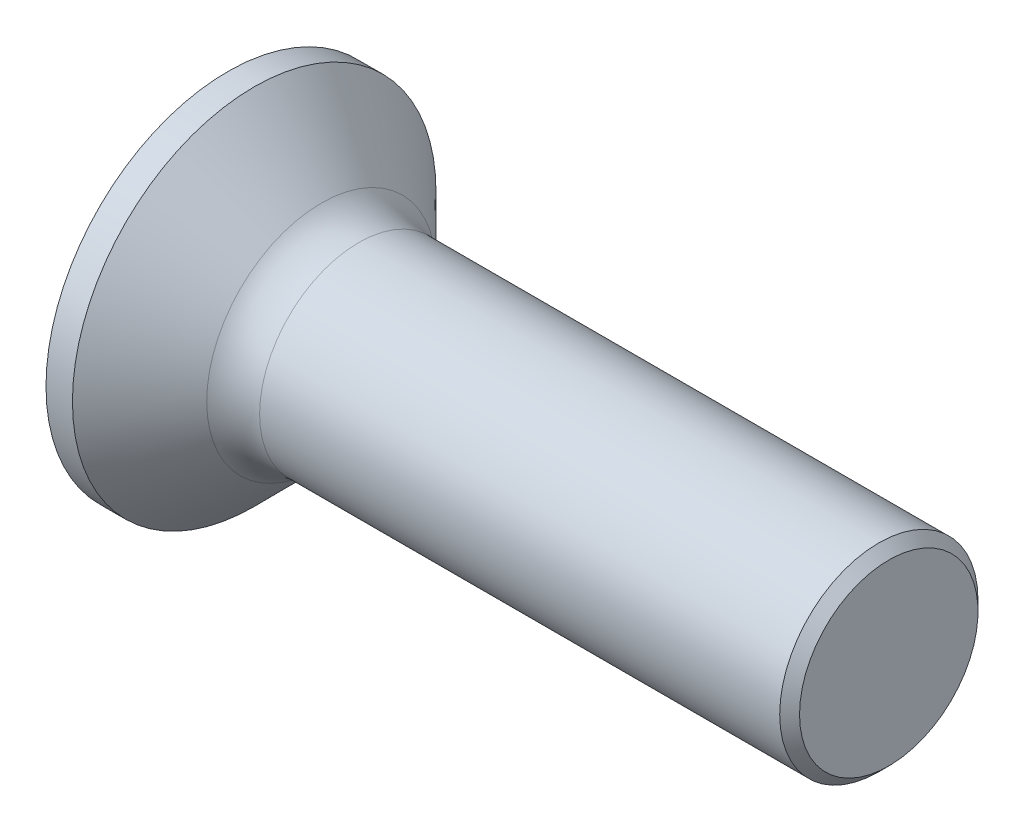
ISO-10303-21;
HEADER;
FILE_DESCRIPTION(('STEP AP214'),'2;1');
FILE_NAME('part.step','',(''),(''),'','','');
FILE_SCHEMA(('AUTOMOTIVE_DESIGN { 1 0 10303 214 1 1 1 1 }'));
ENDSEC;
DATA;
#1=APPLICATION_CONTEXT('core data for automotive mechanical design processes');
#2=APPLICATION_PROTOCOL_DEFINITION('international standard','automotive_design',2000,#1);
#3=PRODUCT_CONTEXT('',#1,'mechanical');
#4=PRODUCT('Part','Part','',(#3));
#5=PRODUCT_RELATED_PRODUCT_CATEGORY('part','',(#4));
#6=PRODUCT_DEFINITION_FORMATION('','',#4);
#7=PRODUCT_DEFINITION_CONTEXT('part definition',#1,'design');
#8=PRODUCT_DEFINITION('design','',#6,#7);
#9=PRODUCT_DEFINITION_SHAPE('','',#8);
#10=(LENGTH_UNIT() NAMED_UNIT(*) SI_UNIT(.MILLI.,.METRE.));
#11=(NAMED_UNIT(*) PLANE_ANGLE_UNIT() SI_UNIT($,.RADIAN.));
#12=(NAMED_UNIT(*) SI_UNIT($,.STERADIAN.) SOLID_ANGLE_UNIT());
#13=UNCERTAINTY_MEASURE_WITH_UNIT(LENGTH_MEASURE(1.E-05),#10,'distance_accuracy_value','');
#14=(GEOMETRIC_REPRESENTATION_CONTEXT(3) GLOBAL_UNCERTAINTY_ASSIGNED_CONTEXT((#13)) GLOBAL_UNIT_ASSIGNED_CONTEXT((#10,
#11,#12)) REPRESENTATION_CONTEXT('',''));
#15=CARTESIAN_POINT('',(0.,0.,0.));
#16=DIRECTION('',(0.,0.,1.));
#17=DIRECTION('',(1.,0.,0.));
#18=AXIS2_PLACEMENT_3D('',#15,#16,#17);
#19=CARTESIAN_POINT('',(0.,0.,-0.425));
#20=DIRECTION('',(0.,0.,1.));
#21=DIRECTION('',(1.,0.,0.));
#22=AXIS2_PLACEMENT_3D('',#19,#20,#21);
#23=PLANE('',#22);
#24=DIRECTION('',(1.,0.,0.));
#25=VECTOR('',#24,1.);
#26=CARTESIAN_POINT('',(0.,-0.419753086419753,-0.425));
#27=LINE('',#26,#25);
#28=CARTESIAN_POINT('',(2.5245,-0.419753086419753,-0.425));
#29=VERTEX_POINT('',#28);
#30=CARTESIAN_POINT('',(1.,-0.419753086419753,-0.425));
#31=VERTEX_POINT('',#30);
#32=EDGE_CURVE('E398',#29,#31,#27,.F.);
#33=ORIENTED_EDGE('',*,*,#32,.T.);
#34=DIRECTION('',(0.,1.,0.));
#35=VECTOR('',#34,1.);
#36=CARTESIAN_POINT('',(1.,0.,-0.425));
#37=LINE('',#36,#35);
#38=CARTESIAN_POINT('',(1.,-0.55003270446328,-0.425));
#39=VERTEX_POINT('',#38);
#40=EDGE_CURVE('E225',#31,#39,#37,.F.);
#41=ORIENTED_EDGE('',*,*,#40,.T.);
#42=DIRECTION('',(1.,0.,0.));
#43=VECTOR('',#42,1.);
#44=CARTESIAN_POINT('',(0.,-0.55003270446328,-0.425));
#45=LINE('',#44,#43);
#46=CARTESIAN_POINT('',(0.,-0.55003270446328,-0.425));
#47=VERTEX_POINT('',#46);
#48=EDGE_CURVE('E199',#39,#47,#45,.F.);
#49=ORIENTED_EDGE('',*,*,#48,.T.);
#50=DIRECTION('',(0.,1.,0.));
#51=VECTOR('',#50,1.);
#52=CARTESIAN_POINT('',(0.,0.,-0.425));
#53=LINE('',#52,#51);
#54=CARTESIAN_POINT('',(0.,-1.7,-0.425));
#55=VERTEX_POINT('',#54);
#56=EDGE_CURVE('E206',#47,#55,#53,.F.);
#57=ORIENTED_EDGE('',*,*,#56,.T.);
#58=DIRECTION('',(1.,0.,0.));
#59=VECTOR('',#58,1.);
#60=CARTESIAN_POINT('',(0.,-1.7,-0.425));
#61=LINE('',#60,#59);
#62=CARTESIAN_POINT('',(0.825,-1.7,-0.425));
#63=VERTEX_POINT('',#62);
#64=EDGE_CURVE('E215',#55,#63,#61,.T.);
#65=ORIENTED_EDGE('',*,*,#64,.T.);
#66=DIRECTION('',(0.799915270195533,0.600112956457372,0.));
#67=VECTOR('',#66,1.);
#68=CARTESIAN_POINT('',(0.825,-1.7,-0.425));
#69=LINE('',#68,#67);
#70=CARTESIAN_POINT('',(2.5245,-0.425,-0.425));
#71=VERTEX_POINT('',#70);
#72=EDGE_CURVE('E392',#63,#71,#69,.T.);
#73=ORIENTED_EDGE('',*,*,#72,.T.);
#74=DIRECTION('',(0.,1.,0.));
#75=VECTOR('',#74,1.);
#76=CARTESIAN_POINT('',(2.5245,0.,-0.425));
#77=LINE('',#76,#75);
#78=EDGE_CURVE('E400',#71,#29,#77,.T.);
#79=ORIENTED_EDGE('',*,*,#78,.T.);
#80=EDGE_LOOP('',(#33,#41,#49,#57,#65,#73,#79));
#81=FACE_BOUND('',#80,.T.);
#82=ADVANCED_FACE('F15',(#81),#23,.T.);
#83=CARTESIAN_POINT('',(0.825,-1.7,0.425));
#84=DIRECTION('',(0.600112956457372,-0.799915270195533,0.));
#85=DIRECTION('',(0.799915270195533,0.600112956457372,0.));
#86=AXIS2_PLACEMENT_3D('',#83,#84,#85);
#87=PLANE('',#86);
#88=DIRECTION('',(0.,0.,1.));
#89=VECTOR('',#88,1.);
#90=CARTESIAN_POINT('',(0.825,-1.7,0.425));
#91=LINE('',#90,#89);
#92=CARTESIAN_POINT('',(0.825,-1.7,0.425));
#93=VERTEX_POINT('',#92);
#94=EDGE_CURVE('E395',#93,#63,#91,.F.);
#95=ORIENTED_EDGE('',*,*,#94,.F.);
#96=DIRECTION('',(0.799915270195533,0.600112956457372,0.));
#97=VECTOR('',#96,1.);
#98=CARTESIAN_POINT('',(0.825,-1.7,0.425));
#99=LINE('',#98,#97);
#100=CARTESIAN_POINT('',(2.5245,-0.425,0.425));
#101=VERTEX_POINT('',#100);
#102=EDGE_CURVE('E383',#93,#101,#99,.T.);
#103=ORIENTED_EDGE('',*,*,#102,.T.);
#104=DIRECTION('',(0.,0.,-1.));
#105=VECTOR('',#104,1.);
#106=CARTESIAN_POINT('',(2.5245,-0.425,0.425));
#107=LINE('',#106,#105);
#108=EDGE_CURVE('E389',#101,#71,#107,.T.);
#109=ORIENTED_EDGE('',*,*,#108,.T.);
#110=ORIENTED_EDGE('',*,*,#72,.F.);
#111=EDGE_LOOP('',(#95,#103,#109,#110));
#112=FACE_BOUND('',#111,.T.);
#113=ADVANCED_FACE('F406',(#112),#87,.F.);
#114=CARTESIAN_POINT('',(2.5245,-0.425,0.425));
#115=DIRECTION('',(1.,0.,0.));
#116=DIRECTION('',(0.,0.,-1.));
#117=AXIS2_PLACEMENT_3D('',#114,#115,#116);
#118=PLANE('',#117);
#119=ORIENTED_EDGE('',*,*,#78,.F.);
#120=ORIENTED_EDGE('',*,*,#108,.F.);
#121=DIRECTION('',(0.,1.,0.));
#122=VECTOR('',#121,1.);
#123=CARTESIAN_POINT('',(2.5245,0.,0.425));
#124=LINE('',#123,#122);
#125=CARTESIAN_POINT('',(2.5245,-0.419753086419753,0.425));
#126=VERTEX_POINT('',#125);
#127=EDGE_CURVE('E381',#101,#126,#124,.T.);
#128=ORIENTED_EDGE('',*,*,#127,.T.);
#129=DIRECTION('',(0.,0.,1.));
#130=VECTOR('',#129,1.);
#131=CARTESIAN_POINT('',(2.5245,-0.419753086419753,0.));
#132=LINE('',#131,#130);
#133=EDGE_CURVE('E357',#29,#126,#132,.T.);
#134=ORIENTED_EDGE('',*,*,#133,.F.);
#135=EDGE_LOOP('',(#119,#120,#128,#134));
#136=FACE_BOUND('',#135,.T.);
#137=ADVANCED_FACE('F411',(#136),#118,.F.);
#138=CARTESIAN_POINT('',(0.,0.,0.425));
#139=DIRECTION('',(0.,0.,1.));
#140=DIRECTION('',(1.,0.,0.));
#141=AXIS2_PLACEMENT_3D('',#138,#139,#140);
#142=PLANE('',#141);
#143=DIRECTION('',(0.,1.,0.));
#144=VECTOR('',#143,1.);
#145=CARTESIAN_POINT('',(1.,0.,0.425));
#146=LINE('',#145,#144);
#147=CARTESIAN_POINT('',(1.,-0.419753086419753,0.425));
#148=VERTEX_POINT('',#147);
#149=CARTESIAN_POINT('',(1.,-0.55003270446328,0.425));
#150=VERTEX_POINT('',#149);
#151=EDGE_CURVE('E379',#148,#150,#146,.F.);
#152=ORIENTED_EDGE('',*,*,#151,.F.);
#153=DIRECTION('',(1.,0.,0.));
#154=VECTOR('',#153,1.);
#155=CARTESIAN_POINT('',(0.,-0.419753086419753,0.425));
#156=LINE('',#155,#154);
#157=EDGE_CURVE('E354',#126,#148,#156,.F.);
#158=ORIENTED_EDGE('',*,*,#157,.F.);
#159=ORIENTED_EDGE('',*,*,#127,.F.);
#160=ORIENTED_EDGE('',*,*,#102,.F.);
#161=DIRECTION('',(1.,0.,0.));
#162=VECTOR('',#161,1.);
#163=CARTESIAN_POINT('',(0.,-1.7,0.425));
#164=LINE('',#163,#162);
#165=CARTESIAN_POINT('',(0.,-1.7,0.425));
#166=VERTEX_POINT('',#165);
#167=EDGE_CURVE('E385',#166,#93,#164,.T.);
#168=ORIENTED_EDGE('',*,*,#167,.F.);
#169=DIRECTION('',(0.,1.,0.));
#170=VECTOR('',#169,1.);
#171=CARTESIAN_POINT('',(0.,0.,0.425));
#172=LINE('',#171,#170);
#173=CARTESIAN_POINT('',(0.,-0.55003270446328,0.425));
#174=VERTEX_POINT('',#173);
#175=EDGE_CURVE('E387',#174,#166,#172,.F.);
#176=ORIENTED_EDGE('',*,*,#175,.F.);
#177=DIRECTION('',(1.,0.,0.));
#178=VECTOR('',#177,1.);
#179=CARTESIAN_POINT('',(0.,-0.55003270446328,0.425));
#180=LINE('',#179,#178);
#181=EDGE_CURVE('E377',#150,#174,#180,.F.);
#182=ORIENTED_EDGE('',*,*,#181,.F.);
#183=EDGE_LOOP('',(#152,#158,#159,#160,#168,#176,#182));
#184=FACE_BOUND('',#183,.T.);
#185=ADVANCED_FACE('F415',(#184),#142,.F.);
#186=CARTESIAN_POINT('',(0.,0.,-0.425));
#187=DIRECTION('',(0.,0.,1.));
#188=DIRECTION('',(1.,0.,0.));
#189=AXIS2_PLACEMENT_3D('',#186,#187,#188);
#190=PLANE('',#189);
#191=DIRECTION('',(1.,0.,0.));
#192=VECTOR('',#191,1.);
#193=CARTESIAN_POINT('',(0.,1.7,-0.425));
#194=LINE('',#193,#192);
#195=CARTESIAN_POINT('',(0.825,1.7,-0.425));
#196=VERTEX_POINT('',#195);
#197=CARTESIAN_POINT('',(0.,1.7,-0.425));
#198=VERTEX_POINT('',#197);
#199=EDGE_CURVE('E363',#196,#198,#194,.F.);
#200=ORIENTED_EDGE('',*,*,#199,.T.);
#201=DIRECTION('',(0.,1.,0.));
#202=VECTOR('',#201,1.);
#203=CARTESIAN_POINT('',(0.,0.,-0.425));
#204=LINE('',#203,#202);
#205=CARTESIAN_POINT('',(0.,0.55003270446328,-0.425));
#206=VERTEX_POINT('',#205);
#207=EDGE_CURVE('E360',#198,#206,#204,.F.);
#208=ORIENTED_EDGE('',*,*,#207,.T.);
#209=DIRECTION('',(1.,0.,0.));
#210=VECTOR('',#209,1.);
#211=CARTESIAN_POINT('',(0.,0.55003270446328,-0.425));
#212=LINE('',#211,#210);
#213=CARTESIAN_POINT('',(1.,0.55003270446328,-0.425));
#214=VERTEX_POINT('',#213);
#215=EDGE_CURVE('E374',#206,#214,#212,.T.);
#216=ORIENTED_EDGE('',*,*,#215,.T.);
#217=DIRECTION('',(0.,1.,0.));
#218=VECTOR('',#217,1.);
#219=CARTESIAN_POINT('',(1.,0.,-0.425));
#220=LINE('',#219,#218);
#221=CARTESIAN_POINT('',(1.,0.419753086419753,-0.425));
#222=VERTEX_POINT('',#221);
#223=EDGE_CURVE('E371',#214,#222,#220,.F.);
#224=ORIENTED_EDGE('',*,*,#223,.T.);
#225=DIRECTION('',(1.,0.,0.));
#226=VECTOR('',#225,1.);
#227=CARTESIAN_POINT('',(0.,0.419753086419753,-0.425));
#228=LINE('',#227,#226);
#229=CARTESIAN_POINT('',(2.5245,0.419753086419753,-0.425));
#230=VERTEX_POINT('',#229);
#231=EDGE_CURVE('E368',#222,#230,#228,.T.);
#232=ORIENTED_EDGE('',*,*,#231,.T.);
#233=DIRECTION('',(0.,1.,0.));
#234=VECTOR('',#233,1.);
#235=CARTESIAN_POINT('',(2.5245,0.,-0.425));
#236=LINE('',#235,#234);
#237=CARTESIAN_POINT('',(2.5245,0.425,-0.425));
#238=VERTEX_POINT('',#237);
#239=EDGE_CURVE('E366',#230,#238,#236,.T.);
#240=ORIENTED_EDGE('',*,*,#239,.T.);
#241=DIRECTION('',(-0.799915270195533,0.600112956457372,0.));
#242=VECTOR('',#241,1.);
#243=CARTESIAN_POINT('',(2.5245,0.425,-0.425));
#244=LINE('',#243,#242);
#245=EDGE_CURVE('E335',#238,#196,#244,.T.);
#246=ORIENTED_EDGE('',*,*,#245,.T.);
#247=EDGE_LOOP('',(#200,#208,#216,#224,#232,#240,#246));
#248=FACE_BOUND('',#247,.T.);
#249=ADVANCED_FACE('F463',(#248),#190,.T.);
#250=CARTESIAN_POINT('',(0.,-0.419753086419753,0.));
#251=DIRECTION('',(0.,1.,0.));
#252=DIRECTION('',(0.,0.,1.));
#253=AXIS2_PLACEMENT_3D('',#250,#251,#252);
#254=PLANE('',#253);
#255=DIRECTION('',(0.,0.,1.));
#256=VECTOR('',#255,1.);
#257=CARTESIAN_POINT('',(0.,-0.419753086419753,0.));
#258=LINE('',#257,#256);
#259=CARTESIAN_POINT('',(0.,-0.419753086419753,-1.7));
#260=VERTEX_POINT('',#259);
#261=CARTESIAN_POINT('',(0.,-0.419753086419753,-0.545630021213276));
#262=VERTEX_POINT('',#261);
#263=EDGE_CURVE('E340',#260,#262,#258,.T.);
#264=ORIENTED_EDGE('',*,*,#263,.T.);
#265=DIRECTION('',(1.,0.,0.));
#266=VECTOR('',#265,1.);
#267=CARTESIAN_POINT('',(0.,-0.419753086419753,-0.545630021213276));
#268=LINE('',#267,#266);
#269=CARTESIAN_POINT('',(1.,-0.419753086419753,-0.545630021213276));
#270=VERTEX_POINT('',#269);
#271=EDGE_CURVE('E338',#262,#270,#268,.T.);
#272=ORIENTED_EDGE('',*,*,#271,.T.);
#273=DIRECTION('',(0.,0.,1.));
#274=VECTOR('',#273,1.);
#275=CARTESIAN_POINT('',(1.,-0.419753086419753,0.));
#276=LINE('',#275,#274);
#277=EDGE_CURVE('E329',#31,#270,#276,.F.);
#278=ORIENTED_EDGE('',*,*,#277,.F.);
#279=ORIENTED_EDGE('',*,*,#32,.F.);
#280=ORIENTED_EDGE('',*,*,#133,.T.);
#281=ORIENTED_EDGE('',*,*,#157,.T.);
#282=DIRECTION('',(0.,0.,1.));
#283=VECTOR('',#282,1.);
#284=CARTESIAN_POINT('',(1.,-0.419753086419753,0.));
#285=LINE('',#284,#283);
#286=CARTESIAN_POINT('',(1.,-0.419753086419753,0.545630021213276));
#287=VERTEX_POINT('',#286);
#288=EDGE_CURVE('E332',#287,#148,#285,.F.);
#289=ORIENTED_EDGE('',*,*,#288,.F.);
#290=DIRECTION('',(1.,0.,0.));
#291=VECTOR('',#290,1.);
#292=CARTESIAN_POINT('',(0.,-0.419753086419753,0.545630021213276));
#293=LINE('',#292,#291);
#294=CARTESIAN_POINT('',(0.,-0.419753086419753,0.545630021213276));
#295=VERTEX_POINT('',#294);
#296=EDGE_CURVE('E351',#287,#295,#293,.F.);
#297=ORIENTED_EDGE('',*,*,#296,.T.);
#298=DIRECTION('',(0.,0.,1.));
#299=VECTOR('',#298,1.);
#300=CARTESIAN_POINT('',(0.,-0.419753086419753,0.));
#301=LINE('',#300,#299);
#302=CARTESIAN_POINT('',(0.,-0.419753086419753,1.7));
#303=VERTEX_POINT('',#302);
#304=EDGE_CURVE('E348',#295,#303,#301,.T.);
#305=ORIENTED_EDGE('',*,*,#304,.T.);
#306=DIRECTION('',(1.,0.,0.));
#307=VECTOR('',#306,1.);
#308=CARTESIAN_POINT('',(0.,-0.419753086419753,1.7));
#309=LINE('',#308,#307);
#310=CARTESIAN_POINT('',(0.825,-0.419753086419753,1.7));
#311=VERTEX_POINT('',#310);
#312=EDGE_CURVE('E346',#303,#311,#309,.T.);
#313=ORIENTED_EDGE('',*,*,#312,.T.);
#314=DIRECTION('',(0.802769432970874,0.,-0.596289558425788));
#315=VECTOR('',#314,1.);
#316=CARTESIAN_POINT('',(0.825,-0.419753086419753,1.7));
#317=LINE('',#316,#315);
#318=CARTESIAN_POINT('',(2.5415,-0.419753086419753,0.425));
#319=VERTEX_POINT('',#318);
#320=EDGE_CURVE('E325',#311,#319,#317,.T.);
#321=ORIENTED_EDGE('',*,*,#320,.T.);
#322=DIRECTION('',(0.,0.,-1.));
#323=VECTOR('',#322,1.);
#324=CARTESIAN_POINT('',(2.5415,-0.419753086419753,0.425));
#325=LINE('',#324,#323);
#326=CARTESIAN_POINT('',(2.5415,-0.419753086419753,-0.425));
#327=VERTEX_POINT('',#326);
#328=EDGE_CURVE('E320',#319,#327,#325,.T.);
#329=ORIENTED_EDGE('',*,*,#328,.T.);
#330=DIRECTION('',(-0.802769432970874,0.,-0.596289558425788));
#331=VECTOR('',#330,1.);
#332=CARTESIAN_POINT('',(2.5415,-0.419753086419753,-0.425));
#333=LINE('',#332,#331);
#334=CARTESIAN_POINT('',(0.825,-0.419753086419753,-1.7));
#335=VERTEX_POINT('',#334);
#336=EDGE_CURVE('E314',#327,#335,#333,.T.);
#337=ORIENTED_EDGE('',*,*,#336,.T.);
#338=DIRECTION('',(1.,0.,0.));
#339=VECTOR('',#338,1.);
#340=CARTESIAN_POINT('',(0.,-0.419753086419753,-1.7));
#341=LINE('',#340,#339);
#342=EDGE_CURVE('E343',#335,#260,#341,.F.);
#343=ORIENTED_EDGE('',*,*,#342,.T.);
#344=EDGE_LOOP('',(#264,#272,#278,#279,#280,#281,#289,#297,#305,#313,#321,#329,#337,#343));
#345=FACE_BOUND('',#344,.T.);
#346=ADVANCED_FACE('F420',(#345),#254,.T.);
#347=CARTESIAN_POINT('',(2.5245,0.425,0.425));
#348=DIRECTION('',(0.600112956457372,0.799915270195533,0.));
#349=DIRECTION('',(-0.799915270195533,0.600112956457372,0.));
#350=AXIS2_PLACEMENT_3D('',#347,#348,#349);
#351=PLANE('',#350);
#352=DIRECTION('',(0.,0.,-1.));
#353=VECTOR('',#352,1.);
#354=CARTESIAN_POINT('',(2.5245,0.425,0.425));
#355=LINE('',#354,#353);
#356=CARTESIAN_POINT('',(2.5245,0.425,0.425));
#357=VERTEX_POINT('',#356);
#358=EDGE_CURVE('E327',#238,#357,#355,.F.);
#359=ORIENTED_EDGE('',*,*,#358,.T.);
#360=DIRECTION('',(-0.799915270195533,0.600112956457372,0.));
#361=VECTOR('',#360,1.);
#362=CARTESIAN_POINT('',(2.5245,0.425,0.425));
#363=LINE('',#362,#361);
#364=CARTESIAN_POINT('',(0.825,1.7,0.425));
#365=VERTEX_POINT('',#364);
#366=EDGE_CURVE('E302',#357,#365,#363,.T.);
#367=ORIENTED_EDGE('',*,*,#366,.T.);
#368=DIRECTION('',(0.,0.,1.));
#369=VECTOR('',#368,1.);
#370=CARTESIAN_POINT('',(0.825,1.7,0.425));
#371=LINE('',#370,#369);
#372=EDGE_CURVE('E309',#365,#196,#371,.F.);
#373=ORIENTED_EDGE('',*,*,#372,.T.);
#374=ORIENTED_EDGE('',*,*,#245,.F.);
#375=EDGE_LOOP('',(#359,#367,#373,#374));
#376=FACE_BOUND('',#375,.T.);
#377=ADVANCED_FACE('F590',(#376),#351,.F.);
#378=CARTESIAN_POINT('',(1.,0.,0.));
#379=DIRECTION('',(-1.,0.,0.));
#380=DIRECTION('',(0.,0.,1.));
#381=AXIS2_PLACEMENT_3D('',#378,#379,#380);
#382=PLANE('',#381);
#383=DIRECTION('',(0.,-0.766044443118978,0.642787609686539));
#384=VECTOR('',#383,1.);
#385=CARTESIAN_POINT('',(1.,-1.20208152801713,1.20208152801713));
#386=LINE('',#385,#384);
#387=CARTESIAN_POINT('',(1.,-1.20208152801713,1.20208152801713));
#388=VERTEX_POINT('',#387);
#389=EDGE_CURVE('E287',#388,#287,#386,.F.);
#390=ORIENTED_EDGE('',*,*,#389,.T.);
#391=ORIENTED_EDGE('',*,*,#288,.T.);
#392=ORIENTED_EDGE('',*,*,#151,.T.);
#393=DIRECTION('',(0.,0.642787609686539,-0.766044443118978));
#394=VECTOR('',#393,1.);
#395=CARTESIAN_POINT('',(1.,-0.193415361212936,0.));
#396=LINE('',#395,#394);
#397=EDGE_CURVE('E285',#150,#388,#396,.F.);
#398=ORIENTED_EDGE('',*,*,#397,.T.);
#399=EDGE_LOOP('',(#390,#391,#392,#398));
#400=FACE_BOUND('',#399,.T.);
#401=ADVANCED_FACE('F587',(#400),#382,.T.);
#402=CARTESIAN_POINT('',(1.,0.,0.));
#403=DIRECTION('',(-1.,0.,0.));
#404=DIRECTION('',(0.,0.,1.));
#405=AXIS2_PLACEMENT_3D('',#402,#403,#404);
#406=PLANE('',#405);
#407=DIRECTION('',(0.,0.766044443118978,0.642787609686539));
#408=VECTOR('',#407,1.);
#409=CARTESIAN_POINT('',(1.,0.,-0.193415361212936));
#410=LINE('',#409,#408);
#411=CARTESIAN_POINT('',(1.,-1.20208152801713,-1.20208152801713));
#412=VERTEX_POINT('',#411);
#413=EDGE_CURVE('E279',#270,#412,#410,.F.);
#414=ORIENTED_EDGE('',*,*,#413,.T.);
#415=DIRECTION('',(0.,-0.642787609686539,-0.766044443118978));
#416=VECTOR('',#415,1.);
#417=CARTESIAN_POINT('',(1.,-1.20208152801713,-1.20208152801713));
#418=LINE('',#417,#416);
#419=EDGE_CURVE('E281',#412,#39,#418,.F.);
#420=ORIENTED_EDGE('',*,*,#419,.T.);
#421=ORIENTED_EDGE('',*,*,#40,.F.);
#422=ORIENTED_EDGE('',*,*,#277,.T.);
#423=EDGE_LOOP('',(#414,#420,#421,#422));
#424=FACE_BOUND('',#423,.T.);
#425=ADVANCED_FACE('F424',(#424),#406,.T.);
#426=CARTESIAN_POINT('',(2.5245,-0.425,0.425));
#427=DIRECTION('',(1.,0.,0.));
#428=DIRECTION('',(0.,0.,-1.));
#429=AXIS2_PLACEMENT_3D('',#426,#427,#428);
#430=PLANE('',#429);
#431=DIRECTION('',(0.,1.,0.));
#432=VECTOR('',#431,1.);
#433=CARTESIAN_POINT('',(2.5245,0.,0.425));
#434=LINE('',#433,#432);
#435=CARTESIAN_POINT('',(2.5245,0.419753086419753,0.425));
#436=VERTEX_POINT('',#435);
#437=EDGE_CURVE('E304',#436,#357,#434,.T.);
#438=ORIENTED_EDGE('',*,*,#437,.T.);
#439=ORIENTED_EDGE('',*,*,#358,.F.);
#440=ORIENTED_EDGE('',*,*,#239,.F.);
#441=DIRECTION('',(0.,0.,1.));
#442=VECTOR('',#441,1.);
#443=CARTESIAN_POINT('',(2.5245,0.419753086419753,0.));
#444=LINE('',#443,#442);
#445=EDGE_CURVE('E273',#230,#436,#444,.T.);
#446=ORIENTED_EDGE('',*,*,#445,.T.);
#447=EDGE_LOOP('',(#438,#439,#440,#446));
#448=FACE_BOUND('',#447,.T.);
#449=ADVANCED_FACE('F580',(#448),#430,.F.);
#450=CARTESIAN_POINT('',(1.,0.,0.));
#451=DIRECTION('',(-1.,0.,0.));
#452=DIRECTION('',(0.,0.,1.));
#453=AXIS2_PLACEMENT_3D('',#450,#451,#452);
#454=PLANE('',#453);
#455=DIRECTION('',(0.,-0.766044443118978,-0.642787609686539));
#456=VECTOR('',#455,1.);
#457=CARTESIAN_POINT('',(1.,0.,0.193415361212936));
#458=LINE('',#457,#456);
#459=CARTESIAN_POINT('',(1.,0.419753086419753,0.545630021213276));
#460=VERTEX_POINT('',#459);
#461=CARTESIAN_POINT('',(1.,1.20208152801713,1.20208152801713));
#462=VERTEX_POINT('',#461);
#463=EDGE_CURVE('E294',#460,#462,#458,.F.);
#464=ORIENTED_EDGE('',*,*,#463,.T.);
#465=DIRECTION('',(0.,0.642787609686539,0.766044443118978));
#466=VECTOR('',#465,1.);
#467=CARTESIAN_POINT('',(1.,1.20208152801713,1.20208152801713));
#468=LINE('',#467,#466);
#469=CARTESIAN_POINT('',(1.,0.55003270446328,0.425));
#470=VERTEX_POINT('',#469);
#471=EDGE_CURVE('E298',#462,#470,#468,.F.);
#472=ORIENTED_EDGE('',*,*,#471,.T.);
#473=DIRECTION('',(0.,1.,0.));
#474=VECTOR('',#473,1.);
#475=CARTESIAN_POINT('',(1.,0.,0.425));
#476=LINE('',#475,#474);
#477=CARTESIAN_POINT('',(1.,0.419753086419753,0.425));
#478=VERTEX_POINT('',#477);
#479=EDGE_CURVE('E307',#470,#478,#476,.F.);
#480=ORIENTED_EDGE('',*,*,#479,.T.);
#481=DIRECTION('',(0.,0.,1.));
#482=VECTOR('',#481,1.);
#483=CARTESIAN_POINT('',(1.,0.419753086419753,0.));
#484=LINE('',#483,#482);
#485=EDGE_CURVE('E268',#478,#460,#484,.T.);
#486=ORIENTED_EDGE('',*,*,#485,.T.);
#487=EDGE_LOOP('',(#464,#472,#480,#486));
#488=FACE_BOUND('',#487,.T.);
#489=ADVANCED_FACE('F577',(#488),#454,.T.);
#490=CARTESIAN_POINT('',(0.825,0.419753086419753,1.7));
#491=DIRECTION('',(0.596289558425788,0.,0.802769432970874));
#492=DIRECTION('',(0.802769432970874,0.,-0.596289558425788));
#493=AXIS2_PLACEMENT_3D('',#490,#491,#492);
#494=PLANE('',#493);
#495=DIRECTION('',(0.,1.,0.));
#496=VECTOR('',#495,1.);
#497=CARTESIAN_POINT('',(0.825,0.419753086419753,1.7));
#498=LINE('',#497,#496);
#499=CARTESIAN_POINT('',(0.825,0.419753086419753,1.7));
#500=VERTEX_POINT('',#499);
#501=EDGE_CURVE('E290',#311,#500,#498,.T.);
#502=ORIENTED_EDGE('',*,*,#501,.T.);
#503=DIRECTION('',(0.802769432970874,0.,-0.596289558425788));
#504=VECTOR('',#503,1.);
#505=CARTESIAN_POINT('',(0.825,0.419753086419753,1.7));
#506=LINE('',#505,#504);
#507=CARTESIAN_POINT('',(2.5415,0.419753086419753,0.425));
#508=VERTEX_POINT('',#507);
#509=EDGE_CURVE('E261',#500,#508,#506,.T.);
#510=ORIENTED_EDGE('',*,*,#509,.T.);
#511=DIRECTION('',(0.,1.,0.));
#512=VECTOR('',#511,1.);
#513=CARTESIAN_POINT('',(2.5415,0.419753086419753,0.425));
#514=LINE('',#513,#512);
#515=EDGE_CURVE('E322',#508,#319,#514,.F.);
#516=ORIENTED_EDGE('',*,*,#515,.T.);
#517=ORIENTED_EDGE('',*,*,#320,.F.);
#518=EDGE_LOOP('',(#502,#510,#516,#517));
#519=FACE_BOUND('',#518,.T.);
#520=ADVANCED_FACE('F546',(#519),#494,.F.);
#521=CARTESIAN_POINT('',(2.5415,0.419753086419753,0.425));
#522=DIRECTION('',(1.,0.,0.));
#523=DIRECTION('',(0.,0.,-1.));
#524=AXIS2_PLACEMENT_3D('',#521,#522,#523);
#525=PLANE('',#524);
#526=ORIENTED_EDGE('',*,*,#515,.F.);
#527=DIRECTION('',(0.,0.,1.));
#528=VECTOR('',#527,1.);
#529=CARTESIAN_POINT('',(2.5415,0.419753086419753,0.));
#530=LINE('',#529,#528);
#531=CARTESIAN_POINT('',(2.5415,0.419753086419753,-0.425));
#532=VERTEX_POINT('',#531);
#533=EDGE_CURVE('E259',#508,#532,#530,.F.);
#534=ORIENTED_EDGE('',*,*,#533,.T.);
#535=DIRECTION('',(0.,1.,0.));
#536=VECTOR('',#535,1.);
#537=CARTESIAN_POINT('',(2.5415,0.419753086419753,-0.425));
#538=LINE('',#537,#536);
#539=EDGE_CURVE('E317',#532,#327,#538,.F.);
#540=ORIENTED_EDGE('',*,*,#539,.T.);
#541=ORIENTED_EDGE('',*,*,#328,.F.);
#542=EDGE_LOOP('',(#526,#534,#540,#541));
#543=FACE_BOUND('',#542,.T.);
#544=ADVANCED_FACE('F544',(#543),#525,.F.);
#545=CARTESIAN_POINT('',(2.5415,0.419753086419753,-0.425));
#546=DIRECTION('',(0.596289558425788,0.,-0.802769432970874));
#547=DIRECTION('',(-0.802769432970874,0.,-0.596289558425788));
#548=AXIS2_PLACEMENT_3D('',#545,#546,#547);
#549=PLANE('',#548);
#550=ORIENTED_EDGE('',*,*,#539,.F.);
#551=DIRECTION('',(-0.802769432970874,0.,-0.596289558425788));
#552=VECTOR('',#551,1.);
#553=CARTESIAN_POINT('',(2.5415,0.419753086419753,-0.425));
#554=LINE('',#553,#552);
#555=CARTESIAN_POINT('',(0.825,0.419753086419753,-1.7));
#556=VERTEX_POINT('',#555);
#557=EDGE_CURVE('E257',#532,#556,#554,.T.);
#558=ORIENTED_EDGE('',*,*,#557,.T.);
#559=DIRECTION('',(0.,1.,0.));
#560=VECTOR('',#559,1.);
#561=CARTESIAN_POINT('',(0.825,0.419753086419753,-1.7));
#562=LINE('',#561,#560);
#563=EDGE_CURVE('E275',#556,#335,#562,.F.);
#564=ORIENTED_EDGE('',*,*,#563,.T.);
#565=ORIENTED_EDGE('',*,*,#336,.F.);
#566=EDGE_LOOP('',(#550,#558,#564,#565));
#567=FACE_BOUND('',#566,.T.);
#568=ADVANCED_FACE('F540',(#567),#549,.F.);
#569=CARTESIAN_POINT('',(1.,0.,0.));
#570=DIRECTION('',(-1.,0.,0.));
#571=DIRECTION('',(0.,0.,1.));
#572=AXIS2_PLACEMENT_3D('',#569,#570,#571);
#573=PLANE('',#572);
#574=DIRECTION('',(0.,0.766044443118978,-0.642787609686539));
#575=VECTOR('',#574,1.);
#576=CARTESIAN_POINT('',(1.,1.20208152801713,-1.20208152801713));
#577=LINE('',#576,#575);
#578=CARTESIAN_POINT('',(1.,1.20208152801713,-1.20208152801713));
#579=VERTEX_POINT('',#578);
#580=CARTESIAN_POINT('',(1.,0.419753086419753,-0.545630021213276));
#581=VERTEX_POINT('',#580);
#582=EDGE_CURVE('E247',#579,#581,#577,.F.);
#583=ORIENTED_EDGE('',*,*,#582,.T.);
#584=DIRECTION('',(0.,0.,1.));
#585=VECTOR('',#584,1.);
#586=CARTESIAN_POINT('',(1.,0.419753086419753,0.));
#587=LINE('',#586,#585);
#588=EDGE_CURVE('E252',#581,#222,#587,.T.);
#589=ORIENTED_EDGE('',*,*,#588,.T.);
#590=ORIENTED_EDGE('',*,*,#223,.F.);
#591=DIRECTION('',(0.,-0.642787609686539,0.766044443118978));
#592=VECTOR('',#591,1.);
#593=CARTESIAN_POINT('',(1.,0.193415361212936,0.));
#594=LINE('',#593,#592);
#595=EDGE_CURVE('E312',#214,#579,#594,.F.);
#596=ORIENTED_EDGE('',*,*,#595,.T.);
#597=EDGE_LOOP('',(#583,#589,#590,#596));
#598=FACE_BOUND('',#597,.T.);
#599=ADVANCED_FACE('F567',(#598),#573,.T.);
#600=CARTESIAN_POINT('',(0.,0.193415361212936,0.));
#601=DIRECTION('',(0.,0.766044443118978,0.642787609686539));
#602=DIRECTION('',(0.,-0.642787609686539,0.766044443118978));
#603=AXIS2_PLACEMENT_3D('',#600,#601,#602);
#604=PLANE('',#603);
#605=DIRECTION('',(0.,-0.642787609686539,0.766044443118978));
#606=VECTOR('',#605,1.);
#607=CARTESIAN_POINT('',(0.,1.20208152801713,-1.20208152801713));
#608=LINE('',#607,#606);
#609=CARTESIAN_POINT('',(0.,1.20208152801713,-1.20208152801713));
#610=VERTEX_POINT('',#609);
#611=EDGE_CURVE('E244',#610,#206,#608,.T.);
#612=ORIENTED_EDGE('',*,*,#611,.F.);
#613=DIRECTION('',(1.,0.,0.));
#614=VECTOR('',#613,1.);
#615=CARTESIAN_POINT('',(0.,1.20208152801713,-1.20208152801713));
#616=LINE('',#615,#614);
#617=EDGE_CURVE('E249',#610,#579,#616,.T.);
#618=ORIENTED_EDGE('',*,*,#617,.T.);
#619=ORIENTED_EDGE('',*,*,#595,.F.);
#620=ORIENTED_EDGE('',*,*,#215,.F.);
#621=EDGE_LOOP('',(#612,#618,#619,#620));
#622=FACE_BOUND('',#621,.T.);
#623=ADVANCED_FACE('F564',(#622),#604,.F.);
#624=CARTESIAN_POINT('',(0.825,1.7,0.425));
#625=DIRECTION('',(0.,1.,0.));
#626=DIRECTION('',(0.,0.,1.));
#627=AXIS2_PLACEMENT_3D('',#624,#625,#626);
#628=PLANE('',#627);
#629=ORIENTED_EDGE('',*,*,#199,.F.);
#630=ORIENTED_EDGE('',*,*,#372,.F.);
#631=DIRECTION('',(1.,0.,0.));
#632=VECTOR('',#631,1.);
#633=CARTESIAN_POINT('',(0.,1.7,0.425));
#634=LINE('',#633,#632);
#635=CARTESIAN_POINT('',(0.,1.7,0.425));
#636=VERTEX_POINT('',#635);
#637=EDGE_CURVE('E300',#365,#636,#634,.F.);
#638=ORIENTED_EDGE('',*,*,#637,.T.);
#639=DIRECTION('',(0.,0.,1.));
#640=VECTOR('',#639,1.);
#641=CARTESIAN_POINT('',(0.,1.7,-1.375));
#642=LINE('',#641,#640);
#643=EDGE_CURVE('E455',#198,#636,#642,.T.);
#644=ORIENTED_EDGE('',*,*,#643,.F.);
#645=EDGE_LOOP('',(#629,#630,#638,#644));
#646=FACE_BOUND('',#645,.T.);
#647=ADVANCED_FACE('F467',(#646),#628,.F.);
#648=CARTESIAN_POINT('',(0.,0.,0.425));
#649=DIRECTION('',(0.,0.,1.));
#650=DIRECTION('',(1.,0.,0.));
#651=AXIS2_PLACEMENT_3D('',#648,#649,#650);
#652=PLANE('',#651);
#653=DIRECTION('',(0.,1.,0.));
#654=VECTOR('',#653,1.);
#655=CARTESIAN_POINT('',(0.,0.,0.425));
#656=LINE('',#655,#654);
#657=CARTESIAN_POINT('',(0.,0.55003270446328,0.425));
#658=VERTEX_POINT('',#657);
#659=EDGE_CURVE('E453',#636,#658,#656,.F.);
#660=ORIENTED_EDGE('',*,*,#659,.F.);
#661=ORIENTED_EDGE('',*,*,#637,.F.);
#662=ORIENTED_EDGE('',*,*,#366,.F.);
#663=ORIENTED_EDGE('',*,*,#437,.F.);
#664=DIRECTION('',(1.,0.,0.));
#665=VECTOR('',#664,1.);
#666=CARTESIAN_POINT('',(0.,0.419753086419753,0.425));
#667=LINE('',#666,#665);
#668=EDGE_CURVE('E270',#436,#478,#667,.F.);
#669=ORIENTED_EDGE('',*,*,#668,.T.);
#670=ORIENTED_EDGE('',*,*,#479,.F.);
#671=DIRECTION('',(1.,0.,0.));
#672=VECTOR('',#671,1.);
#673=CARTESIAN_POINT('',(0.,0.55003270446328,0.425));
#674=LINE('',#673,#672);
#675=EDGE_CURVE('E296',#470,#658,#674,.F.);
#676=ORIENTED_EDGE('',*,*,#675,.T.);
#677=EDGE_LOOP('',(#660,#661,#662,#663,#669,#670,#676));
#678=FACE_BOUND('',#677,.T.);
#679=ADVANCED_FACE('F472',(#678),#652,.F.);
#680=CARTESIAN_POINT('',(0.,1.20208152801713,1.20208152801713));
#681=DIRECTION('',(0.,0.766044443118978,-0.642787609686539));
#682=DIRECTION('',(0.,0.642787609686539,0.766044443118978));
#683=AXIS2_PLACEMENT_3D('',#680,#681,#682);
#684=PLANE('',#683);
#685=ORIENTED_EDGE('',*,*,#471,.F.);
#686=DIRECTION('',(1.,0.,0.));
#687=VECTOR('',#686,1.);
#688=CARTESIAN_POINT('',(0.,1.20208152801713,1.20208152801713));
#689=LINE('',#688,#687);
#690=CARTESIAN_POINT('',(0.,1.20208152801713,1.20208152801713));
#691=VERTEX_POINT('',#690);
#692=EDGE_CURVE('E292',#462,#691,#689,.F.);
#693=ORIENTED_EDGE('',*,*,#692,.T.);
#694=DIRECTION('',(0.,0.642787609686539,0.766044443118978));
#695=VECTOR('',#694,1.);
#696=CARTESIAN_POINT('',(0.,0.55003270446328,0.425));
#697=LINE('',#696,#695);
#698=EDGE_CURVE('E450',#658,#691,#697,.T.);
#699=ORIENTED_EDGE('',*,*,#698,.F.);
#700=ORIENTED_EDGE('',*,*,#675,.F.);
#701=EDGE_LOOP('',(#685,#693,#699,#700));
#702=FACE_BOUND('',#701,.T.);
#703=ADVANCED_FACE('F479',(#702),#684,.F.);
#704=CARTESIAN_POINT('',(0.,0.,0.193415361212936));
#705=DIRECTION('',(0.,-0.642787609686539,0.766044443118978));
#706=DIRECTION('',(0.,-0.766044443118978,-0.642787609686539));
#707=AXIS2_PLACEMENT_3D('',#704,#705,#706);
#708=PLANE('',#707);
#709=DIRECTION('',(0.,-0.766044443118978,-0.642787609686539));
#710=VECTOR('',#709,1.);
#711=CARTESIAN_POINT('',(0.,1.20208152801713,1.20208152801713));
#712=LINE('',#711,#710);
#713=CARTESIAN_POINT('',(0.,0.419753086419753,0.545630021213276));
#714=VERTEX_POINT('',#713);
#715=EDGE_CURVE('E447',#691,#714,#712,.T.);
#716=ORIENTED_EDGE('',*,*,#715,.F.);
#717=ORIENTED_EDGE('',*,*,#692,.F.);
#718=ORIENTED_EDGE('',*,*,#463,.F.);
#719=DIRECTION('',(1.,0.,0.));
#720=VECTOR('',#719,1.);
#721=CARTESIAN_POINT('',(0.,0.419753086419753,0.545630021213276));
#722=LINE('',#721,#720);
#723=EDGE_CURVE('E266',#460,#714,#722,.F.);
#724=ORIENTED_EDGE('',*,*,#723,.T.);
#725=EDGE_LOOP('',(#716,#717,#718,#724));
#726=FACE_BOUND('',#725,.T.);
#727=ADVANCED_FACE('F483',(#726),#708,.F.);
#728=CARTESIAN_POINT('',(-1.,0.419753086419753,1.7));
#729=DIRECTION('',(0.,0.,1.));
#730=DIRECTION('',(1.,0.,0.));
#731=AXIS2_PLACEMENT_3D('',#728,#729,#730);
#732=PLANE('',#731);
#733=DIRECTION('',(1.,0.,0.));
#734=VECTOR('',#733,1.);
#735=CARTESIAN_POINT('',(0.,0.419753086419753,1.7));
#736=LINE('',#735,#734);
#737=CARTESIAN_POINT('',(0.,0.419753086419753,1.7));
#738=VERTEX_POINT('',#737);
#739=EDGE_CURVE('E263',#738,#500,#736,.T.);
#740=ORIENTED_EDGE('',*,*,#739,.T.);
#741=ORIENTED_EDGE('',*,*,#501,.F.);
#742=ORIENTED_EDGE('',*,*,#312,.F.);
#743=DIRECTION('',(0.,1.,0.));
#744=VECTOR('',#743,1.);
#745=CARTESIAN_POINT('',(0.,0.,1.7));
#746=LINE('',#745,#744);
#747=EDGE_CURVE('E441',#738,#303,#746,.F.);
#748=ORIENTED_EDGE('',*,*,#747,.F.);
#749=EDGE_LOOP('',(#740,#741,#742,#748));
#750=FACE_BOUND('',#749,.T.);
#751=ADVANCED_FACE('F548',(#750),#732,.F.);
#752=CARTESIAN_POINT('',(0.,-1.20208152801713,1.20208152801713));
#753=DIRECTION('',(0.,0.642787609686539,0.766044443118978));
#754=DIRECTION('',(0.,-0.766044443118978,0.642787609686539));
#755=AXIS2_PLACEMENT_3D('',#752,#753,#754);
#756=PLANE('',#755);
#757=ORIENTED_EDGE('',*,*,#389,.F.);
#758=DIRECTION('',(1.,0.,0.));
#759=VECTOR('',#758,1.);
#760=CARTESIAN_POINT('',(0.,-1.20208152801713,1.20208152801713));
#761=LINE('',#760,#759);
#762=CARTESIAN_POINT('',(0.,-1.20208152801713,1.20208152801713));
#763=VERTEX_POINT('',#762);
#764=EDGE_CURVE('E283',#388,#763,#761,.F.);
#765=ORIENTED_EDGE('',*,*,#764,.T.);
#766=DIRECTION('',(0.,-0.766044443118978,0.642787609686539));
#767=VECTOR('',#766,1.);
#768=CARTESIAN_POINT('',(0.,-0.419753086419753,0.545630021213276));
#769=LINE('',#768,#767);
#770=EDGE_CURVE('E438',#295,#763,#769,.T.);
#771=ORIENTED_EDGE('',*,*,#770,.F.);
#772=ORIENTED_EDGE('',*,*,#296,.F.);
#773=EDGE_LOOP('',(#757,#765,#771,#772));
#774=FACE_BOUND('',#773,.T.);
#775=ADVANCED_FACE('F495',(#774),#756,.F.);
#776=CARTESIAN_POINT('',(0.,-0.193415361212936,0.));
#777=DIRECTION('',(0.,-0.766044443118978,-0.642787609686539));
#778=DIRECTION('',(0.,0.642787609686539,-0.766044443118978));
#779=AXIS2_PLACEMENT_3D('',#776,#777,#778);
#780=PLANE('',#779);
#781=DIRECTION('',(0.,0.642787609686539,-0.766044443118978));
#782=VECTOR('',#781,1.);
#783=CARTESIAN_POINT('',(0.,-1.20208152801713,1.20208152801713));
#784=LINE('',#783,#782);
#785=EDGE_CURVE('E435',#763,#174,#784,.T.);
#786=ORIENTED_EDGE('',*,*,#785,.F.);
#787=ORIENTED_EDGE('',*,*,#764,.F.);
#788=ORIENTED_EDGE('',*,*,#397,.F.);
#789=ORIENTED_EDGE('',*,*,#181,.T.);
#790=EDGE_LOOP('',(#786,#787,#788,#789));
#791=FACE_BOUND('',#790,.T.);
#792=ADVANCED_FACE('F502',(#791),#780,.F.);
#793=CARTESIAN_POINT('',(-1.,-1.7,0.425));
#794=DIRECTION('',(0.,-1.,0.));
#795=DIRECTION('',(0.,0.,-1.));
#796=AXIS2_PLACEMENT_3D('',#793,#794,#795);
#797=PLANE('',#796);
#798=ORIENTED_EDGE('',*,*,#167,.T.);
#799=ORIENTED_EDGE('',*,*,#94,.T.);
#800=ORIENTED_EDGE('',*,*,#64,.F.);
#801=DIRECTION('',(0.,0.,1.));
#802=VECTOR('',#801,1.);
#803=CARTESIAN_POINT('',(0.,-1.7,-1.375));
#804=LINE('',#803,#802);
#805=EDGE_CURVE('E212',#166,#55,#804,.F.);
#806=ORIENTED_EDGE('',*,*,#805,.F.);
#807=EDGE_LOOP('',(#798,#799,#800,#806));
#808=FACE_BOUND('',#807,.T.);
#809=ADVANCED_FACE('F500',(#808),#797,.F.);
#810=CARTESIAN_POINT('',(0.,-1.20208152801713,-1.20208152801713));
#811=DIRECTION('',(0.,-0.766044443118978,0.642787609686539));
#812=DIRECTION('',(0.,-0.642787609686539,-0.766044443118978));
#813=AXIS2_PLACEMENT_3D('',#810,#811,#812);
#814=PLANE('',#813);
#815=ORIENTED_EDGE('',*,*,#419,.F.);
#816=DIRECTION('',(1.,0.,0.));
#817=VECTOR('',#816,1.);
#818=CARTESIAN_POINT('',(0.,-1.20208152801713,-1.20208152801713));
#819=LINE('',#818,#817);
#820=CARTESIAN_POINT('',(0.,-1.20208152801713,-1.20208152801713));
#821=VERTEX_POINT('',#820);
#822=EDGE_CURVE('E219',#412,#821,#819,.F.);
#823=ORIENTED_EDGE('',*,*,#822,.T.);
#824=DIRECTION('',(0.,-0.642787609686539,-0.766044443118978));
#825=VECTOR('',#824,1.);
#826=CARTESIAN_POINT('',(0.,-0.55003270446328,-0.425));
#827=LINE('',#826,#825);
#828=EDGE_CURVE('E210',#47,#821,#827,.T.);
#829=ORIENTED_EDGE('',*,*,#828,.F.);
#830=ORIENTED_EDGE('',*,*,#48,.F.);
#831=EDGE_LOOP('',(#815,#823,#829,#830));
#832=FACE_BOUND('',#831,.T.);
#833=ADVANCED_FACE('F217',(#832),#814,.F.);
#834=CARTESIAN_POINT('',(0.,0.,-0.193415361212936));
#835=DIRECTION('',(0.,0.642787609686539,-0.766044443118978));
#836=DIRECTION('',(0.,0.766044443118978,0.642787609686539));
#837=AXIS2_PLACEMENT_3D('',#834,#835,#836);
#838=PLANE('',#837);
#839=DIRECTION('',(0.,0.766044443118978,0.642787609686539));
#840=VECTOR('',#839,1.);
#841=CARTESIAN_POINT('',(0.,-1.20208152801713,-1.20208152801713));
#842=LINE('',#841,#840);
#843=EDGE_CURVE('E221',#821,#262,#842,.T.);
#844=ORIENTED_EDGE('',*,*,#843,.F.);
#845=ORIENTED_EDGE('',*,*,#822,.F.);
#846=ORIENTED_EDGE('',*,*,#413,.F.);
#847=ORIENTED_EDGE('',*,*,#271,.F.);
#848=EDGE_LOOP('',(#844,#845,#846,#847));
#849=FACE_BOUND('',#848,.T.);
#850=ADVANCED_FACE('F426',(#849),#838,.F.);
#851=CARTESIAN_POINT('',(0.825,0.419753086419753,-1.7));
#852=DIRECTION('',(0.,0.,-1.));
#853=DIRECTION('',(-1.,0.,0.));
#854=AXIS2_PLACEMENT_3D('',#851,#852,#853);
#855=PLANE('',#854);
#856=ORIENTED_EDGE('',*,*,#342,.F.);
#857=ORIENTED_EDGE('',*,*,#563,.F.);
#858=DIRECTION('',(1.,0.,0.));
#859=VECTOR('',#858,1.);
#860=CARTESIAN_POINT('',(0.,0.419753086419753,-1.7));
#861=LINE('',#860,#859);
#862=CARTESIAN_POINT('',(0.,0.419753086419753,-1.7));
#863=VERTEX_POINT('',#862);
#864=EDGE_CURVE('E255',#556,#863,#861,.F.);
#865=ORIENTED_EDGE('',*,*,#864,.T.);
#866=DIRECTION('',(0.,1.,0.));
#867=VECTOR('',#866,1.);
#868=CARTESIAN_POINT('',(0.,0.,-1.7));
#869=LINE('',#868,#867);
#870=EDGE_CURVE('E427',#260,#863,#869,.T.);
#871=ORIENTED_EDGE('',*,*,#870,.F.);
#872=EDGE_LOOP('',(#856,#857,#865,#871));
#873=FACE_BOUND('',#872,.T.);
#874=ADVANCED_FACE('F536',(#873),#855,.F.);
#875=CARTESIAN_POINT('',(0.,0.419753086419753,0.));
#876=DIRECTION('',(0.,1.,0.));
#877=DIRECTION('',(0.,0.,1.));
#878=AXIS2_PLACEMENT_3D('',#875,#876,#877);
#879=PLANE('',#878);
#880=DIRECTION('',(1.,0.,0.));
#881=VECTOR('',#880,1.);
#882=CARTESIAN_POINT('',(0.,0.419753086419753,-0.545630021213276));
#883=LINE('',#882,#881);
#884=CARTESIAN_POINT('',(0.,0.419753086419753,-0.545630021213276));
#885=VERTEX_POINT('',#884);
#886=EDGE_CURVE('E33',#581,#885,#883,.F.);
#887=ORIENTED_EDGE('',*,*,#886,.T.);
#888=DIRECTION('',(0.,0.,1.));
#889=VECTOR('',#888,1.);
#890=CARTESIAN_POINT('',(0.,0.419753086419753,-1.375));
#891=LINE('',#890,#889);
#892=EDGE_CURVE('E430',#863,#885,#891,.T.);
#893=ORIENTED_EDGE('',*,*,#892,.F.);
#894=ORIENTED_EDGE('',*,*,#864,.F.);
#895=ORIENTED_EDGE('',*,*,#557,.F.);
#896=ORIENTED_EDGE('',*,*,#533,.F.);
#897=ORIENTED_EDGE('',*,*,#509,.F.);
#898=ORIENTED_EDGE('',*,*,#739,.F.);
#899=DIRECTION('',(0.,0.,1.));
#900=VECTOR('',#899,1.);
#901=CARTESIAN_POINT('',(0.,0.419753086419753,-1.375));
#902=LINE('',#901,#900);
#903=EDGE_CURVE('E444',#714,#738,#902,.T.);
#904=ORIENTED_EDGE('',*,*,#903,.F.);
#905=ORIENTED_EDGE('',*,*,#723,.F.);
#906=ORIENTED_EDGE('',*,*,#485,.F.);
#907=ORIENTED_EDGE('',*,*,#668,.F.);
#908=ORIENTED_EDGE('',*,*,#445,.F.);
#909=ORIENTED_EDGE('',*,*,#231,.F.);
#910=ORIENTED_EDGE('',*,*,#588,.F.);
#911=EDGE_LOOP('',(#887,#893,#894,#895,#896,#897,#898,#904,#905,#906,#907,#908,#909,#910));
#912=FACE_BOUND('',#911,.T.);
#913=ADVANCED_FACE('F487',(#912),#879,.F.);
#914=CARTESIAN_POINT('',(0.,1.20208152801713,-1.20208152801713));
#915=DIRECTION('',(0.,-0.642787609686539,-0.766044443118978));
#916=DIRECTION('',(0.,0.766044443118978,-0.642787609686539));
#917=AXIS2_PLACEMENT_3D('',#914,#915,#916);
#918=PLANE('',#917);
#919=ORIENTED_EDGE('',*,*,#582,.F.);
#920=ORIENTED_EDGE('',*,*,#617,.F.);
#921=DIRECTION('',(0.,0.766044443118978,-0.642787609686539));
#922=VECTOR('',#921,1.);
#923=CARTESIAN_POINT('',(0.,0.419753086419753,-0.545630021213276));
#924=LINE('',#923,#922);
#925=EDGE_CURVE('E241',#885,#610,#924,.T.);
#926=ORIENTED_EDGE('',*,*,#925,.F.);
#927=ORIENTED_EDGE('',*,*,#886,.F.);
#928=EDGE_LOOP('',(#919,#920,#926,#927));
#929=FACE_BOUND('',#928,.T.);
#930=ADVANCED_FACE('F722',(#929),#918,.F.);
#931=CARTESIAN_POINT('',(0.,0.,-1.375));
#932=DIRECTION('',(-1.,0.,0.));
#933=DIRECTION('',(0.,0.,1.));
#934=AXIS2_PLACEMENT_3D('',#931,#932,#933);
#935=PLANE('',#934);
#936=CARTESIAN_POINT('',(0.,0.,0.));
#937=DIRECTION('',(-1.,0.,0.));
#938=DIRECTION('',(0.,0.,1.));
#939=AXIS2_PLACEMENT_3D('',#936,#937,#938);
#940=CIRCLE('',#939,2.75);
#941=CARTESIAN_POINT('',(0.,0.,2.75));
#942=VERTEX_POINT('',#941);
#943=EDGE_CURVE('E18',#942,#942,#940,.F.);
#944=ORIENTED_EDGE('',*,*,#943,.F.);
#945=EDGE_LOOP('',(#944));
#946=FACE_BOUND('',#945,.T.);
#947=ORIENTED_EDGE('',*,*,#892,.T.);
#948=ORIENTED_EDGE('',*,*,#925,.T.);
#949=ORIENTED_EDGE('',*,*,#611,.T.);
#950=ORIENTED_EDGE('',*,*,#207,.F.);
#951=ORIENTED_EDGE('',*,*,#643,.T.);
#952=ORIENTED_EDGE('',*,*,#659,.T.);
#953=ORIENTED_EDGE('',*,*,#698,.T.);
#954=ORIENTED_EDGE('',*,*,#715,.T.);
#955=ORIENTED_EDGE('',*,*,#903,.T.);
#956=ORIENTED_EDGE('',*,*,#747,.T.);
#957=ORIENTED_EDGE('',*,*,#304,.F.);
#958=ORIENTED_EDGE('',*,*,#770,.T.);
#959=ORIENTED_EDGE('',*,*,#785,.T.);
#960=ORIENTED_EDGE('',*,*,#175,.T.);
#961=ORIENTED_EDGE('',*,*,#805,.T.);
#962=ORIENTED_EDGE('',*,*,#56,.F.);
#963=ORIENTED_EDGE('',*,*,#828,.T.);
#964=ORIENTED_EDGE('',*,*,#843,.T.);
#965=ORIENTED_EDGE('',*,*,#263,.F.);
#966=ORIENTED_EDGE('',*,*,#870,.T.);
#967=EDGE_LOOP('',(#947,#948,#949,#950,#951,#952,#953,#954,#955,#956,#957,#958,#959,#960,#961,
#962,#963,#964,#965,#966));
#968=FACE_BOUND('',#967,.T.);
#969=ADVANCED_FACE('F208',(#946,#968),#935,.T.);
#970=CARTESIAN_POINT('',(0.2,0.,0.));
#971=DIRECTION('',(-1.,0.,0.));
#972=DIRECTION('',(0.,0.,1.));
#973=AXIS2_PLACEMENT_3D('',#970,#971,#972);
#974=CYLINDRICAL_SURFACE('',#973,2.75);
#975=ORIENTED_EDGE('',*,*,#943,.T.);
#976=EDGE_LOOP('',(#975));
#977=FACE_BOUND('',#976,.T.);
#978=CARTESIAN_POINT('',(0.400000000070122,0.,0.));
#979=DIRECTION('',(-1.,0.,0.));
#980=DIRECTION('',(0.,0.,-1.));
#981=AXIS2_PLACEMENT_3D('',#978,#979,#980);
#982=CIRCLE('',#981,2.74999999999181);
#983=CARTESIAN_POINT('',(0.400000000070122,0.,-2.74999999999181));
#984=VERTEX_POINT('',#983);
#985=EDGE_CURVE('E231',#984,#984,#982,.F.);
#986=ORIENTED_EDGE('',*,*,#985,.F.);
#987=EDGE_LOOP('',(#986));
#988=FACE_BOUND('',#987,.T.);
#989=ADVANCED_FACE('F736',(#977,#988),#974,.T.);
#990=CARTESIAN_POINT('',(10.,0.,-0.674999999999999));
#991=DIRECTION('',(1.,0.,0.));
#992=DIRECTION('',(0.,1.,0.));
#993=AXIS2_PLACEMENT_3D('',#990,#991,#992);
#994=PLANE('',#993);
#995=CARTESIAN_POINT('',(10.0000000000477,0.,0.));
#996=DIRECTION('',(-1.,0.,0.));
#997=DIRECTION('',(0.,0.,1.));
#998=AXIS2_PLACEMENT_3D('',#995,#996,#997);
#999=CIRCLE('',#998,1.3499999998885);
#1000=CARTESIAN_POINT('',(10.0000000000477,0.,1.3499999998885));
#1001=VERTEX_POINT('',#1000);
#1002=EDGE_CURVE('E228',#1001,#1001,#999,.T.);
#1003=ORIENTED_EDGE('',*,*,#1002,.F.);
#1004=EDGE_LOOP('',(#1003));
#1005=FACE_BOUND('',#1004,.T.);
#1006=ADVANCED_FACE('F744',(#1005),#994,.T.);
#1007=CARTESIAN_POINT('',(0.399999999956435,0.,0.));
#1008=DIRECTION('',(-1.,0.,0.));
#1009=DIRECTION('',(0.,0.,1.));
#1010=AXIS2_PLACEMENT_3D('',#1007,#1008,#1009);
#1011=CONICAL_SURFACE('',#1010,2.75000000004866,0.785398163397448);
#1012=ORIENTED_EDGE('',*,*,#985,.T.);
#1013=EDGE_LOOP('',(#1012));
#1014=FACE_BOUND('',#1013,.T.);
#1015=CARTESIAN_POINT('',(1.41568542494924,0.,0.));
#1016=DIRECTION('',(-1.,0.,0.));
#1017=DIRECTION('',(0.,0.,1.));
#1018=AXIS2_PLACEMENT_3D('',#1015,#1016,#1017);
#1019=CIRCLE('',#1018,1.73431457505076);
#1020=CARTESIAN_POINT('',(1.41568542494924,0.,1.73431457505076));
#1021=VERTEX_POINT('',#1020);
#1022=EDGE_CURVE('E230',#1021,#1021,#1019,.F.);
#1023=ORIENTED_EDGE('',*,*,#1022,.F.);
#1024=EDGE_LOOP('',(#1023));
#1025=FACE_BOUND('',#1024,.T.);
#1026=ADVANCED_FACE('F752',(#1014,#1025),#1011,.T.);
#1027=CARTESIAN_POINT('',(9.84999999985803,0.,0.));
#1028=DIRECTION('',(-1.,0.,0.));
#1029=DIRECTION('',(0.,0.,1.));
#1030=AXIS2_PLACEMENT_3D('',#1027,#1028,#1029);
#1031=CONICAL_SURFACE('',#1030,1.50000000013506,0.785398163586926);
#1032=ORIENTED_EDGE('',*,*,#1002,.T.);
#1033=EDGE_LOOP('',(#1032));
#1034=FACE_BOUND('',#1033,.T.);
#1035=CARTESIAN_POINT('',(9.85,0.,0.));
#1036=DIRECTION('',(-1.,0.,0.));
#1037=DIRECTION('',(0.,0.,1.));
#1038=AXIS2_PLACEMENT_3D('',#1035,#1036,#1037);
#1039=CIRCLE('',#1038,1.5);
#1040=CARTESIAN_POINT('',(9.85,0.,1.5));
#1041=VERTEX_POINT('',#1040);
#1042=EDGE_CURVE('E24',#1041,#1041,#1039,.T.);
#1043=ORIENTED_EDGE('',*,*,#1042,.F.);
#1044=EDGE_LOOP('',(#1043));
#1045=FACE_BOUND('',#1044,.T.);
#1046=ADVANCED_FACE('F519',(#1034,#1045),#1031,.T.);
#1047=CARTESIAN_POINT('',(1.98137084989848,0.,0.));
#1048=DIRECTION('',(-1.,0.,0.));
#1049=DIRECTION('',(0.,0.,1.));
#1050=AXIS2_PLACEMENT_3D('',#1047,#1048,#1049);
#1051=TOROIDAL_SURFACE('',#1050,2.3,0.8);
#1052=CARTESIAN_POINT('',(1.98137084989848,0.,0.));
#1053=DIRECTION('',(-1.,0.,0.));
#1054=DIRECTION('',(0.,0.,1.));
#1055=AXIS2_PLACEMENT_3D('',#1052,#1053,#1054);
#1056=CIRCLE('',#1055,1.5);
#1057=CARTESIAN_POINT('',(1.98137084989848,0.,1.5));
#1058=VERTEX_POINT('',#1057);
#1059=EDGE_CURVE('E9',#1058,#1058,#1056,.F.);
#1060=ORIENTED_EDGE('',*,*,#1059,.F.);
#1061=EDGE_LOOP('',(#1060));
#1062=FACE_BOUND('',#1061,.T.);
#1063=ORIENTED_EDGE('',*,*,#1022,.T.);
#1064=EDGE_LOOP('',(#1063));
#1065=FACE_BOUND('',#1064,.T.);
#1066=ADVANCED_FACE('F513',(#1062,#1065),#1051,.F.);
#1067=CARTESIAN_POINT('',(5.91568542494924,0.,0.));
#1068=DIRECTION('',(-1.,0.,0.));
#1069=DIRECTION('',(0.,0.,1.));
#1070=AXIS2_PLACEMENT_3D('',#1067,#1068,#1069);
#1071=CYLINDRICAL_SURFACE('',#1070,1.5);
#1072=ORIENTED_EDGE('',*,*,#1042,.T.);
#1073=EDGE_LOOP('',(#1072));
#1074=FACE_BOUND('',#1073,.T.);
#1075=ORIENTED_EDGE('',*,*,#1059,.T.);
#1076=EDGE_LOOP('',(#1075));
#1077=FACE_BOUND('',#1076,.T.);
#1078=ADVANCED_FACE('F511',(#1074,#1077),#1071,.T.);
#1079=CLOSED_SHELL('',(#82,#113,#137,#185,#249,#346,#377,#401,#425,#449,#489,#520,#544,#568,
#599,#623,#647,#679,#703,#727,#751,#775,#792,#809,#833,#850,#874,#913,#930,#969,#989,#1006,
#1026,#1046,#1066,#1078));
#1080=MANIFOLD_SOLID_BREP('B1',#1079);
#1081=ADVANCED_BREP_SHAPE_REPRESENTATION('',(#18,#1080),#14);
#1082=SHAPE_DEFINITION_REPRESENTATION(#9,#1081);
ENDSEC;
END-ISO-10303-21;
